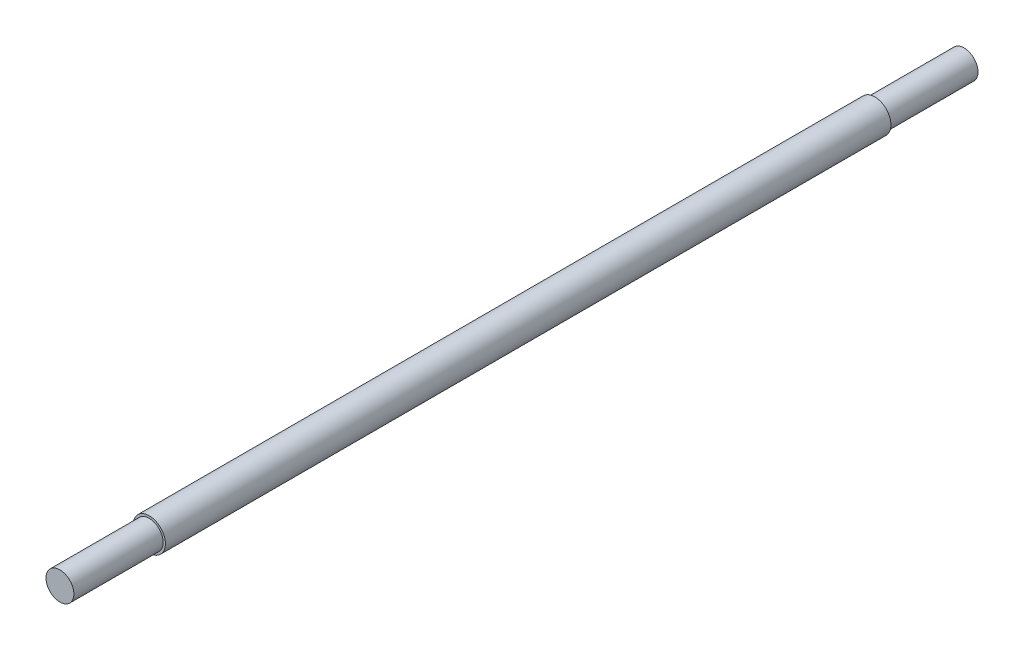
ISO-10303-21;
HEADER;
FILE_DESCRIPTION(('STEP AP214'),'2;1');
FILE_NAME('part.step','',(''),(''),'','','');
FILE_SCHEMA(('AUTOMOTIVE_DESIGN { 1 0 10303 214 1 1 1 1 }'));
ENDSEC;
DATA;
#1=APPLICATION_CONTEXT('core data for automotive mechanical design processes');
#2=APPLICATION_PROTOCOL_DEFINITION('international standard','automotive_design',2000,#1);
#3=PRODUCT_CONTEXT('',#1,'mechanical');
#4=PRODUCT('Part','Part','',(#3));
#5=PRODUCT_RELATED_PRODUCT_CATEGORY('part','',(#4));
#6=PRODUCT_DEFINITION_FORMATION('','',#4);
#7=PRODUCT_DEFINITION_CONTEXT('part definition',#1,'design');
#8=PRODUCT_DEFINITION('design','',#6,#7);
#9=PRODUCT_DEFINITION_SHAPE('','',#8);
#10=(LENGTH_UNIT() NAMED_UNIT(*) SI_UNIT(.MILLI.,.METRE.));
#11=(NAMED_UNIT(*) PLANE_ANGLE_UNIT() SI_UNIT($,.RADIAN.));
#12=(NAMED_UNIT(*) SI_UNIT($,.STERADIAN.) SOLID_ANGLE_UNIT());
#13=UNCERTAINTY_MEASURE_WITH_UNIT(LENGTH_MEASURE(1.E-05),#10,'distance_accuracy_value','');
#14=(GEOMETRIC_REPRESENTATION_CONTEXT(3) GLOBAL_UNCERTAINTY_ASSIGNED_CONTEXT((#13)) GLOBAL_UNIT_ASSIGNED_CONTEXT((#10,
#11,#12)) REPRESENTATION_CONTEXT('',''));
#15=CARTESIAN_POINT('',(0.,0.,0.));
#16=DIRECTION('',(0.,0.,1.));
#17=DIRECTION('',(1.,0.,0.));
#18=AXIS2_PLACEMENT_3D('',#15,#16,#17);
#19=CARTESIAN_POINT('',(0.,0.,-405.));
#20=DIRECTION('',(0.,0.,1.));
#21=DIRECTION('',(-1.,0.,0.));
#22=AXIS2_PLACEMENT_3D('',#19,#20,#21);
#23=CYLINDRICAL_SURFACE('',#22,12.5);
#24=CARTESIAN_POINT('',(0.,0.,-405.));
#25=DIRECTION('',(0.,0.,1.));
#26=DIRECTION('',(1.,0.,0.));
#27=AXIS2_PLACEMENT_3D('',#24,#25,#26);
#28=CIRCLE('',#27,12.5);
#29=CARTESIAN_POINT('',(12.5,0.,-405.));
#30=VERTEX_POINT('',#29);
#31=EDGE_CURVE('E11',#30,#30,#28,.T.);
#32=ORIENTED_EDGE('',*,*,#31,.T.);
#33=EDGE_LOOP('',(#32));
#34=FACE_BOUND('',#33,.T.);
#35=CARTESIAN_POINT('',(0.,0.,-325.));
#36=DIRECTION('',(0.,0.,1.));
#37=DIRECTION('',(1.,0.,0.));
#38=AXIS2_PLACEMENT_3D('',#35,#36,#37);
#39=CIRCLE('',#38,12.5);
#40=CARTESIAN_POINT('',(12.5,0.,-325.));
#41=VERTEX_POINT('',#40);
#42=EDGE_CURVE('E47',#41,#41,#39,.T.);
#43=ORIENTED_EDGE('',*,*,#42,.F.);
#44=EDGE_LOOP('',(#43));
#45=FACE_BOUND('',#44,.T.);
#46=ADVANCED_FACE('F44',(#34,#45),#23,.T.);
#47=CARTESIAN_POINT('',(0.,0.,-405.));
#48=DIRECTION('',(0.,0.,-1.));
#49=DIRECTION('',(1.,0.,0.));
#50=AXIS2_PLACEMENT_3D('',#47,#48,#49);
#51=PLANE('',#50);
#52=ORIENTED_EDGE('',*,*,#31,.F.);
#53=EDGE_LOOP('',(#52));
#54=FACE_BOUND('',#53,.T.);
#55=ADVANCED_FACE('F59',(#54),#51,.T.);
#56=CARTESIAN_POINT('',(0.,0.,-325.));
#57=DIRECTION('',(0.,0.,-1.));
#58=DIRECTION('',(1.,0.,0.));
#59=AXIS2_PLACEMENT_3D('',#56,#57,#58);
#60=PLANE('',#59);
#61=ORIENTED_EDGE('',*,*,#42,.T.);
#62=EDGE_LOOP('',(#61));
#63=FACE_BOUND('',#62,.T.);
#64=ADVANCED_FACE('F56',(#63),#60,.F.);
#65=CLOSED_SHELL('',(#46,#55,#64));
#66=MANIFOLD_SOLID_BREP('B2',#65);
#67=CARTESIAN_POINT('',(0.,0.,405.));
#68=DIRECTION('',(0.,0.,-1.));
#69=DIRECTION('',(-1.,0.,0.));
#70=AXIS2_PLACEMENT_3D('',#67,#68,#69);
#71=CYLINDRICAL_SURFACE('',#70,12.5);
#72=CARTESIAN_POINT('',(0.,0.,405.));
#73=DIRECTION('',(0.,0.,1.));
#74=DIRECTION('',(1.,0.,0.));
#75=AXIS2_PLACEMENT_3D('',#72,#73,#74);
#76=CIRCLE('',#75,12.5);
#77=CARTESIAN_POINT('',(12.5,0.,405.));
#78=VERTEX_POINT('',#77);
#79=EDGE_CURVE('E43',#78,#78,#76,.T.);
#80=ORIENTED_EDGE('',*,*,#79,.F.);
#81=EDGE_LOOP('',(#80));
#82=FACE_BOUND('',#81,.T.);
#83=CARTESIAN_POINT('',(0.,0.,325.));
#84=DIRECTION('',(0.,0.,1.));
#85=DIRECTION('',(1.,0.,0.));
#86=AXIS2_PLACEMENT_3D('',#83,#84,#85);
#87=CIRCLE('',#86,12.5);
#88=CARTESIAN_POINT('',(12.5,0.,325.));
#89=VERTEX_POINT('',#88);
#90=EDGE_CURVE('E95',#89,#89,#87,.T.);
#91=ORIENTED_EDGE('',*,*,#90,.T.);
#92=EDGE_LOOP('',(#91));
#93=FACE_BOUND('',#92,.T.);
#94=ADVANCED_FACE('F92',(#82,#93),#71,.T.);
#95=CARTESIAN_POINT('',(0.,0.,405.));
#96=DIRECTION('',(0.,0.,1.));
#97=DIRECTION('',(1.,0.,0.));
#98=AXIS2_PLACEMENT_3D('',#95,#96,#97);
#99=PLANE('',#98);
#100=ORIENTED_EDGE('',*,*,#79,.T.);
#101=EDGE_LOOP('',(#100));
#102=FACE_BOUND('',#101,.T.);
#103=ADVANCED_FACE('F107',(#102),#99,.T.);
#104=CARTESIAN_POINT('',(0.,0.,325.));
#105=DIRECTION('',(0.,0.,1.));
#106=DIRECTION('',(1.,0.,0.));
#107=AXIS2_PLACEMENT_3D('',#104,#105,#106);
#108=PLANE('',#107);
#109=ORIENTED_EDGE('',*,*,#90,.F.);
#110=EDGE_LOOP('',(#109));
#111=FACE_BOUND('',#110,.T.);
#112=ADVANCED_FACE('F105',(#111),#108,.F.);
#113=CLOSED_SHELL('',(#94,#103,#112));
#114=MANIFOLD_SOLID_BREP('B6',#113);
#115=CARTESIAN_POINT('',(0.,0.,325.));
#116=DIRECTION('',(0.,0.,-1.));
#117=DIRECTION('',(-1.,0.,0.));
#118=AXIS2_PLACEMENT_3D('',#115,#116,#117);
#119=CYLINDRICAL_SURFACE('',#118,14.5);
#120=CARTESIAN_POINT('',(0.,0.,325.));
#121=DIRECTION('',(0.,0.,1.));
#122=DIRECTION('',(1.,0.,0.));
#123=AXIS2_PLACEMENT_3D('',#120,#121,#122);
#124=CIRCLE('',#123,14.5);
#125=CARTESIAN_POINT('',(14.5,0.,325.));
#126=VERTEX_POINT('',#125);
#127=EDGE_CURVE('E91',#126,#126,#124,.T.);
#128=ORIENTED_EDGE('',*,*,#127,.F.);
#129=EDGE_LOOP('',(#128));
#130=FACE_BOUND('',#129,.T.);
#131=CARTESIAN_POINT('',(0.,0.,-325.));
#132=DIRECTION('',(0.,0.,1.));
#133=DIRECTION('',(1.,0.,0.));
#134=AXIS2_PLACEMENT_3D('',#131,#132,#133);
#135=CIRCLE('',#134,14.5);
#136=CARTESIAN_POINT('',(14.5,0.,-325.));
#137=VERTEX_POINT('',#136);
#138=EDGE_CURVE('E136',#137,#137,#135,.T.);
#139=ORIENTED_EDGE('',*,*,#138,.T.);
#140=EDGE_LOOP('',(#139));
#141=FACE_BOUND('',#140,.T.);
#142=ADVANCED_FACE('F133',(#130,#141),#119,.T.);
#143=CARTESIAN_POINT('',(0.,0.,325.));
#144=DIRECTION('',(0.,0.,1.));
#145=DIRECTION('',(1.,0.,0.));
#146=AXIS2_PLACEMENT_3D('',#143,#144,#145);
#147=PLANE('',#146);
#148=ORIENTED_EDGE('',*,*,#127,.T.);
#149=EDGE_LOOP('',(#148));
#150=FACE_BOUND('',#149,.T.);
#151=ADVANCED_FACE('F148',(#150),#147,.T.);
#152=CARTESIAN_POINT('',(0.,0.,-325.));
#153=DIRECTION('',(0.,0.,1.));
#154=DIRECTION('',(1.,0.,0.));
#155=AXIS2_PLACEMENT_3D('',#152,#153,#154);
#156=PLANE('',#155);
#157=ORIENTED_EDGE('',*,*,#138,.F.);
#158=EDGE_LOOP('',(#157));
#159=FACE_BOUND('',#158,.T.);
#160=ADVANCED_FACE('F146',(#159),#156,.F.);
#161=CLOSED_SHELL('',(#142,#151,#160));
#162=MANIFOLD_SOLID_BREP('B38',#161);
#163=ADVANCED_BREP_SHAPE_REPRESENTATION('',(#18,#66,#114,#162),#14);
#164=SHAPE_DEFINITION_REPRESENTATION(#9,#163);
ENDSEC;
END-ISO-10303-21;
